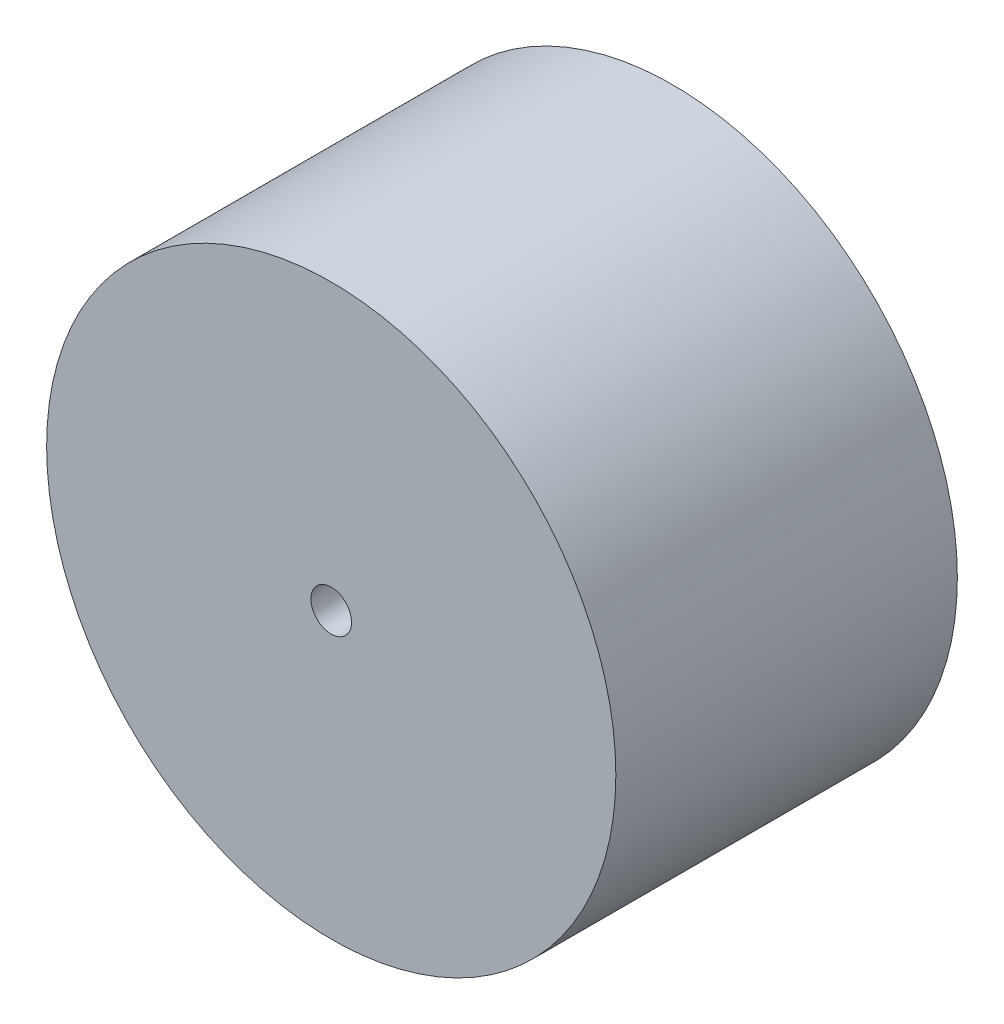
ISO-10303-21;
HEADER;
FILE_DESCRIPTION(('STEP AP214'),'2;1');
FILE_NAME('part.step','',(''),(''),'','','');
FILE_SCHEMA(('AUTOMOTIVE_DESIGN { 1 0 10303 214 1 1 1 1 }'));
ENDSEC;
DATA;
#1=APPLICATION_CONTEXT('core data for automotive mechanical design processes');
#2=APPLICATION_PROTOCOL_DEFINITION('international standard','automotive_design',2000,#1);
#3=PRODUCT_CONTEXT('',#1,'mechanical');
#4=PRODUCT('Part','Part','',(#3));
#5=PRODUCT_RELATED_PRODUCT_CATEGORY('part','',(#4));
#6=PRODUCT_DEFINITION_FORMATION('','',#4);
#7=PRODUCT_DEFINITION_CONTEXT('part definition',#1,'design');
#8=PRODUCT_DEFINITION('design','',#6,#7);
#9=PRODUCT_DEFINITION_SHAPE('','',#8);
#10=(LENGTH_UNIT() NAMED_UNIT(*) SI_UNIT(.MILLI.,.METRE.));
#11=(NAMED_UNIT(*) PLANE_ANGLE_UNIT() SI_UNIT($,.RADIAN.));
#12=(NAMED_UNIT(*) SI_UNIT($,.STERADIAN.) SOLID_ANGLE_UNIT());
#13=UNCERTAINTY_MEASURE_WITH_UNIT(LENGTH_MEASURE(1.E-05),#10,'distance_accuracy_value','');
#14=(GEOMETRIC_REPRESENTATION_CONTEXT(3) GLOBAL_UNCERTAINTY_ASSIGNED_CONTEXT((#13)) GLOBAL_UNIT_ASSIGNED_CONTEXT((#10,
#11,#12)) REPRESENTATION_CONTEXT('',''));
#15=CARTESIAN_POINT('',(0.,0.,0.));
#16=DIRECTION('',(0.,0.,1.));
#17=DIRECTION('',(1.,0.,0.));
#18=AXIS2_PLACEMENT_3D('',#15,#16,#17);
#19=CARTESIAN_POINT('',(0.,0.,42.));
#20=DIRECTION('',(0.,0.,1.));
#21=DIRECTION('',(1.,0.,0.));
#22=AXIS2_PLACEMENT_3D('',#19,#20,#21);
#23=PLANE('',#22);
#24=CARTESIAN_POINT('',(0.,0.,42.));
#25=DIRECTION('',(0.,0.,1.));
#26=DIRECTION('',(1.,0.,0.));
#27=AXIS2_PLACEMENT_3D('',#24,#25,#26);
#28=CIRCLE('',#27,35.);
#29=CARTESIAN_POINT('',(35.,0.,42.));
#30=VERTEX_POINT('',#29);
#31=EDGE_CURVE('E10',#30,#30,#28,.T.);
#32=ORIENTED_EDGE('',*,*,#31,.T.);
#33=EDGE_LOOP('',(#32));
#34=FACE_BOUND('',#33,.T.);
#35=CARTESIAN_POINT('',(0.,0.,42.));
#36=DIRECTION('',(0.,0.,1.));
#37=DIRECTION('',(1.,0.,0.));
#38=AXIS2_PLACEMENT_3D('',#35,#36,#37);
#39=CIRCLE('',#38,2.5);
#40=CARTESIAN_POINT('',(2.5,0.,42.));
#41=VERTEX_POINT('',#40);
#42=EDGE_CURVE('E50',#41,#41,#39,.T.);
#43=ORIENTED_EDGE('',*,*,#42,.F.);
#44=EDGE_LOOP('',(#43));
#45=FACE_BOUND('',#44,.T.);
#46=ADVANCED_FACE('F37',(#34,#45),#23,.T.);
#47=CARTESIAN_POINT('',(0.,0.,0.));
#48=DIRECTION('',(0.,0.,1.));
#49=DIRECTION('',(1.,0.,0.));
#50=AXIS2_PLACEMENT_3D('',#47,#48,#49);
#51=PLANE('',#50);
#52=CARTESIAN_POINT('',(0.,0.,0.));
#53=DIRECTION('',(0.,0.,1.));
#54=DIRECTION('',(1.,0.,0.));
#55=AXIS2_PLACEMENT_3D('',#52,#53,#54);
#56=CIRCLE('',#55,35.);
#57=CARTESIAN_POINT('',(35.,0.,0.));
#58=VERTEX_POINT('',#57);
#59=EDGE_CURVE('E41',#58,#58,#56,.T.);
#60=ORIENTED_EDGE('',*,*,#59,.F.);
#61=EDGE_LOOP('',(#60));
#62=FACE_BOUND('',#61,.T.);
#63=CARTESIAN_POINT('',(0.,0.,0.));
#64=DIRECTION('',(0.,0.,1.));
#65=DIRECTION('',(1.,0.,0.));
#66=AXIS2_PLACEMENT_3D('',#63,#64,#65);
#67=CIRCLE('',#66,2.5);
#68=CARTESIAN_POINT('',(2.5,0.,0.));
#69=VERTEX_POINT('',#68);
#70=EDGE_CURVE('E52',#69,#69,#67,.T.);
#71=ORIENTED_EDGE('',*,*,#70,.T.);
#72=EDGE_LOOP('',(#71));
#73=FACE_BOUND('',#72,.T.);
#74=ADVANCED_FACE('F64',(#62,#73),#51,.F.);
#75=CARTESIAN_POINT('',(0.,0.,42.));
#76=DIRECTION('',(0.,0.,-1.));
#77=DIRECTION('',(-1.,0.,0.));
#78=AXIS2_PLACEMENT_3D('',#75,#76,#77);
#79=CYLINDRICAL_SURFACE('',#78,35.);
#80=ORIENTED_EDGE('',*,*,#31,.F.);
#81=EDGE_LOOP('',(#80));
#82=FACE_BOUND('',#81,.T.);
#83=ORIENTED_EDGE('',*,*,#59,.T.);
#84=EDGE_LOOP('',(#83));
#85=FACE_BOUND('',#84,.T.);
#86=ADVANCED_FACE('F39',(#82,#85),#79,.T.);
#87=CARTESIAN_POINT('',(0.,0.,42.));
#88=DIRECTION('',(0.,0.,-1.));
#89=DIRECTION('',(-1.,0.,0.));
#90=AXIS2_PLACEMENT_3D('',#87,#88,#89);
#91=CYLINDRICAL_SURFACE('',#90,2.5);
#92=ORIENTED_EDGE('',*,*,#42,.T.);
#93=EDGE_LOOP('',(#92));
#94=FACE_BOUND('',#93,.T.);
#95=ORIENTED_EDGE('',*,*,#70,.F.);
#96=EDGE_LOOP('',(#95));
#97=FACE_BOUND('',#96,.T.);
#98=ADVANCED_FACE('F60',(#94,#97),#91,.F.);
#99=CLOSED_SHELL('',(#46,#74,#86,#98));
#100=MANIFOLD_SOLID_BREP('B2',#99);
#101=ADVANCED_BREP_SHAPE_REPRESENTATION('',(#18,#100),#14);
#102=SHAPE_DEFINITION_REPRESENTATION(#9,#101);
ENDSEC;
END-ISO-10303-21;
